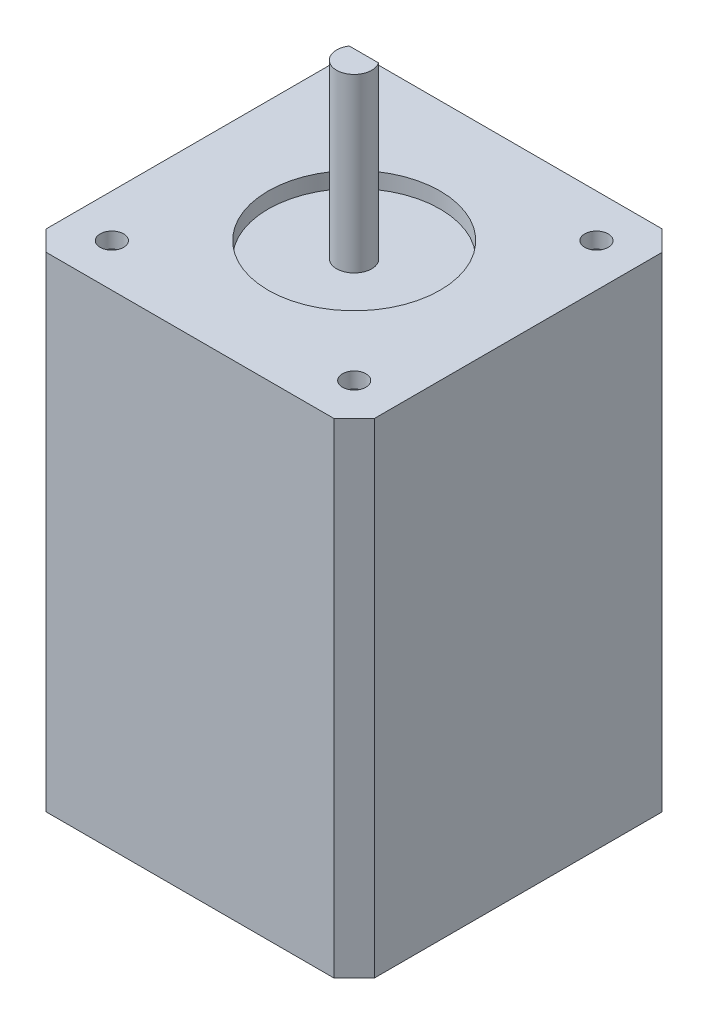
ISO-10303-21;
HEADER;
FILE_DESCRIPTION(('STEP AP214'),'2;1');
FILE_NAME('part.step','',(''),(''),'','','');
FILE_SCHEMA(('AUTOMOTIVE_DESIGN { 1 0 10303 214 1 1 1 1 }'));
ENDSEC;
DATA;
#1=APPLICATION_CONTEXT('core data for automotive mechanical design processes');
#2=APPLICATION_PROTOCOL_DEFINITION('international standard','automotive_design',2000,#1);
#3=PRODUCT_CONTEXT('',#1,'mechanical');
#4=PRODUCT('Part','Part','',(#3));
#5=PRODUCT_RELATED_PRODUCT_CATEGORY('part','',(#4));
#6=PRODUCT_DEFINITION_FORMATION('','',#4);
#7=PRODUCT_DEFINITION_CONTEXT('part definition',#1,'design');
#8=PRODUCT_DEFINITION('design','',#6,#7);
#9=PRODUCT_DEFINITION_SHAPE('','',#8);
#10=(LENGTH_UNIT() NAMED_UNIT(*) SI_UNIT(.MILLI.,.METRE.));
#11=(NAMED_UNIT(*) PLANE_ANGLE_UNIT() SI_UNIT($,.RADIAN.));
#12=(NAMED_UNIT(*) SI_UNIT($,.STERADIAN.) SOLID_ANGLE_UNIT());
#13=UNCERTAINTY_MEASURE_WITH_UNIT(LENGTH_MEASURE(1.E-05),#10,'distance_accuracy_value','');
#14=(GEOMETRIC_REPRESENTATION_CONTEXT(3) GLOBAL_UNCERTAINTY_ASSIGNED_CONTEXT((#13)) GLOBAL_UNIT_ASSIGNED_CONTEXT((#10,
#11,#12)) REPRESENTATION_CONTEXT('',''));
#15=CARTESIAN_POINT('',(0.,0.,0.));
#16=DIRECTION('',(0.,0.,1.));
#17=DIRECTION('',(1.,0.,0.));
#18=AXIS2_PLACEMENT_3D('',#15,#16,#17);
#19=CARTESIAN_POINT('',(15.5,-60.,-15.5));
#20=DIRECTION('',(0.,1.,0.));
#21=DIRECTION('',(0.,0.,1.));
#22=AXIS2_PLACEMENT_3D('',#19,#20,#21);
#23=CYLINDRICAL_SURFACE('',#22,1.5);
#24=CARTESIAN_POINT('',(15.5,2.,-15.5));
#25=DIRECTION('',(0.,1.,0.));
#26=DIRECTION('',(0.,0.,1.));
#27=AXIS2_PLACEMENT_3D('',#24,#25,#26);
#28=CIRCLE('',#27,1.5);
#29=CARTESIAN_POINT('',(15.5,2.,-14.));
#30=VERTEX_POINT('',#29);
#31=EDGE_CURVE('E149',#30,#30,#28,.T.);
#32=ORIENTED_EDGE('',*,*,#31,.T.);
#33=EDGE_LOOP('',(#32));
#34=FACE_BOUND('',#33,.T.);
#35=CARTESIAN_POINT('',(15.5,0.,-15.5));
#36=DIRECTION('',(0.,-1.,0.));
#37=DIRECTION('',(0.,0.,-1.));
#38=AXIS2_PLACEMENT_3D('',#35,#36,#37);
#39=CIRCLE('',#38,1.5);
#40=CARTESIAN_POINT('',(15.5,0.,-17.));
#41=VERTEX_POINT('',#40);
#42=EDGE_CURVE('E11',#41,#41,#39,.F.);
#43=ORIENTED_EDGE('',*,*,#42,.F.);
#44=EDGE_LOOP('',(#43));
#45=FACE_BOUND('',#44,.T.);
#46=ADVANCED_FACE('F41',(#34,#45),#23,.F.);
#47=CARTESIAN_POINT('',(-15.5,-60.,-15.5));
#48=DIRECTION('',(0.,1.,0.));
#49=DIRECTION('',(0.,0.,1.));
#50=AXIS2_PLACEMENT_3D('',#47,#48,#49);
#51=CYLINDRICAL_SURFACE('',#50,1.5);
#52=CARTESIAN_POINT('',(-15.5,2.,-15.5));
#53=DIRECTION('',(0.,1.,0.));
#54=DIRECTION('',(0.,0.,1.));
#55=AXIS2_PLACEMENT_3D('',#52,#53,#54);
#56=CIRCLE('',#55,1.5);
#57=CARTESIAN_POINT('',(-15.5,2.,-14.));
#58=VERTEX_POINT('',#57);
#59=EDGE_CURVE('E152',#58,#58,#56,.T.);
#60=ORIENTED_EDGE('',*,*,#59,.T.);
#61=EDGE_LOOP('',(#60));
#62=FACE_BOUND('',#61,.T.);
#63=CARTESIAN_POINT('',(-15.5,0.,-15.5));
#64=DIRECTION('',(0.,-1.,0.));
#65=DIRECTION('',(0.,0.,-1.));
#66=AXIS2_PLACEMENT_3D('',#63,#64,#65);
#67=CIRCLE('',#66,1.5);
#68=CARTESIAN_POINT('',(-15.5,0.,-17.));
#69=VERTEX_POINT('',#68);
#70=EDGE_CURVE('E49',#69,#69,#67,.F.);
#71=ORIENTED_EDGE('',*,*,#70,.F.);
#72=EDGE_LOOP('',(#71));
#73=FACE_BOUND('',#72,.T.);
#74=ADVANCED_FACE('F226',(#62,#73),#51,.F.);
#75=CARTESIAN_POINT('',(15.5,-60.,15.5));
#76=DIRECTION('',(0.,1.,0.));
#77=DIRECTION('',(0.,0.,1.));
#78=AXIS2_PLACEMENT_3D('',#75,#76,#77);
#79=CYLINDRICAL_SURFACE('',#78,1.5);
#80=CARTESIAN_POINT('',(15.5,2.,15.5));
#81=DIRECTION('',(0.,1.,0.));
#82=DIRECTION('',(0.,0.,1.));
#83=AXIS2_PLACEMENT_3D('',#80,#81,#82);
#84=CIRCLE('',#83,1.5);
#85=CARTESIAN_POINT('',(15.5,2.,17.));
#86=VERTEX_POINT('',#85);
#87=EDGE_CURVE('E143',#86,#86,#84,.T.);
#88=ORIENTED_EDGE('',*,*,#87,.T.);
#89=EDGE_LOOP('',(#88));
#90=FACE_BOUND('',#89,.T.);
#91=CARTESIAN_POINT('',(15.5,0.,15.5));
#92=DIRECTION('',(0.,-1.,0.));
#93=DIRECTION('',(0.,0.,-1.));
#94=AXIS2_PLACEMENT_3D('',#91,#92,#93);
#95=CIRCLE('',#94,1.5);
#96=CARTESIAN_POINT('',(15.5,0.,14.));
#97=VERTEX_POINT('',#96);
#98=EDGE_CURVE('E219',#97,#97,#95,.F.);
#99=ORIENTED_EDGE('',*,*,#98,.F.);
#100=EDGE_LOOP('',(#99));
#101=FACE_BOUND('',#100,.T.);
#102=ADVANCED_FACE('F228',(#90,#101),#79,.F.);
#103=CARTESIAN_POINT('',(-15.5,-60.,15.5));
#104=DIRECTION('',(0.,1.,0.));
#105=DIRECTION('',(0.,0.,1.));
#106=AXIS2_PLACEMENT_3D('',#103,#104,#105);
#107=CYLINDRICAL_SURFACE('',#106,1.5);
#108=CARTESIAN_POINT('',(-15.5,2.,15.5));
#109=DIRECTION('',(0.,1.,0.));
#110=DIRECTION('',(0.,0.,1.));
#111=AXIS2_PLACEMENT_3D('',#108,#109,#110);
#112=CIRCLE('',#111,1.5);
#113=CARTESIAN_POINT('',(-15.5,2.,17.));
#114=VERTEX_POINT('',#113);
#115=EDGE_CURVE('E146',#114,#114,#112,.T.);
#116=ORIENTED_EDGE('',*,*,#115,.T.);
#117=EDGE_LOOP('',(#116));
#118=FACE_BOUND('',#117,.T.);
#119=CARTESIAN_POINT('',(-15.5,0.,15.5));
#120=DIRECTION('',(0.,-1.,0.));
#121=DIRECTION('',(0.,0.,-1.));
#122=AXIS2_PLACEMENT_3D('',#119,#120,#121);
#123=CIRCLE('',#122,1.5);
#124=CARTESIAN_POINT('',(-15.5,0.,14.));
#125=VERTEX_POINT('',#124);
#126=EDGE_CURVE('E216',#125,#125,#123,.F.);
#127=ORIENTED_EDGE('',*,*,#126,.F.);
#128=EDGE_LOOP('',(#127));
#129=FACE_BOUND('',#128,.T.);
#130=ADVANCED_FACE('F235',(#118,#129),#107,.F.);
#131=CARTESIAN_POINT('',(0.,0.,0.));
#132=DIRECTION('',(0.,-1.,0.));
#133=DIRECTION('',(0.,0.,-1.));
#134=AXIS2_PLACEMENT_3D('',#131,#132,#133);
#135=PLANE('',#134);
#136=CARTESIAN_POINT('',(0.,0.,0.));
#137=DIRECTION('',(0.,-1.,0.));
#138=DIRECTION('',(0.,0.,-1.));
#139=AXIS2_PLACEMENT_3D('',#136,#137,#138);
#140=CIRCLE('',#139,11.);
#141=CARTESIAN_POINT('',(0.,0.,-11.));
#142=VERTEX_POINT('',#141);
#143=EDGE_CURVE('E200',#142,#142,#140,.F.);
#144=ORIENTED_EDGE('',*,*,#143,.T.);
#145=EDGE_LOOP('',(#144));
#146=FACE_BOUND('',#145,.T.);
#147=CARTESIAN_POINT('',(0.,0.,0.));
#148=DIRECTION('',(0.,1.,0.));
#149=DIRECTION('',(0.,0.,1.));
#150=AXIS2_PLACEMENT_3D('',#147,#148,#149);
#151=CIRCLE('',#150,2.25);
#152=CARTESIAN_POINT('',(-1.87082869338696,0.,-1.24999999999999));
#153=VERTEX_POINT('',#152);
#154=CARTESIAN_POINT('',(1.87082869338697,0.,-1.25));
#155=VERTEX_POINT('',#154);
#156=EDGE_CURVE('E55',#153,#155,#151,.T.);
#157=ORIENTED_EDGE('',*,*,#156,.F.);
#158=DIRECTION('',(1.,0.,0.));
#159=VECTOR('',#158,1.);
#160=CARTESIAN_POINT('',(0.,0.,-1.25));
#161=LINE('',#160,#159);
#162=EDGE_CURVE('E125',#153,#155,#161,.T.);
#163=ORIENTED_EDGE('',*,*,#162,.T.);
#164=EDGE_LOOP('',(#157,#163));
#165=FACE_BOUND('',#164,.T.);
#166=ADVANCED_FACE('F244',(#146,#165),#135,.F.);
#167=CARTESIAN_POINT('',(0.,-60.,0.));
#168=DIRECTION('',(0.,1.,0.));
#169=DIRECTION('',(0.,0.,1.));
#170=AXIS2_PLACEMENT_3D('',#167,#168,#169);
#171=CYLINDRICAL_SURFACE('',#170,11.);
#172=CARTESIAN_POINT('',(0.,2.,0.));
#173=DIRECTION('',(0.,1.,0.));
#174=DIRECTION('',(0.,0.,1.));
#175=AXIS2_PLACEMENT_3D('',#172,#173,#174);
#176=CIRCLE('',#175,11.);
#177=CARTESIAN_POINT('',(0.,2.,11.));
#178=VERTEX_POINT('',#177);
#179=EDGE_CURVE('E127',#178,#178,#176,.T.);
#180=ORIENTED_EDGE('',*,*,#179,.T.);
#181=EDGE_LOOP('',(#180));
#182=FACE_BOUND('',#181,.T.);
#183=ORIENTED_EDGE('',*,*,#143,.F.);
#184=EDGE_LOOP('',(#183));
#185=FACE_BOUND('',#184,.T.);
#186=ADVANCED_FACE('F43',(#182,#185),#171,.F.);
#187=CARTESIAN_POINT('',(19.7010309278352,-60.,19.701030927835));
#188=DIRECTION('',(-0.707106781186551,0.,-0.707106781186544));
#189=DIRECTION('',(-0.707106781186544,0.,0.707106781186551));
#190=AXIS2_PLACEMENT_3D('',#187,#188,#189);
#191=PLANE('',#190);
#192=DIRECTION('',(0.,1.,0.));
#193=VECTOR('',#192,1.);
#194=CARTESIAN_POINT('',(21.,-60.,18.4020618556701));
#195=LINE('',#194,#193);
#196=CARTESIAN_POINT('',(21.,-60.,18.4020618556701));
#197=VERTEX_POINT('',#196);
#198=CARTESIAN_POINT('',(21.,2.,18.4020618556701));
#199=VERTEX_POINT('',#198);
#200=EDGE_CURVE('E197',#197,#199,#195,.T.);
#201=ORIENTED_EDGE('',*,*,#200,.T.);
#202=DIRECTION('',(-0.707106781186544,0.,0.707106781186551));
#203=VECTOR('',#202,1.);
#204=CARTESIAN_POINT('',(19.7010309278352,2.,19.701030927835));
#205=LINE('',#204,#203);
#206=CARTESIAN_POINT('',(18.4020618556701,2.,21.));
#207=VERTEX_POINT('',#206);
#208=EDGE_CURVE('E155',#199,#207,#205,.T.);
#209=ORIENTED_EDGE('',*,*,#208,.T.);
#210=DIRECTION('',(0.,1.,0.));
#211=VECTOR('',#210,1.);
#212=CARTESIAN_POINT('',(18.4020618556701,-60.,21.));
#213=LINE('',#212,#211);
#214=CARTESIAN_POINT('',(18.4020618556701,-60.,21.));
#215=VERTEX_POINT('',#214);
#216=EDGE_CURVE('E198',#215,#207,#213,.T.);
#217=ORIENTED_EDGE('',*,*,#216,.F.);
#218=DIRECTION('',(-0.707106781186544,0.,0.707106781186551));
#219=VECTOR('',#218,1.);
#220=CARTESIAN_POINT('',(19.7010309278352,-60.,19.701030927835));
#221=LINE('',#220,#219);
#222=EDGE_CURVE('E63',#197,#215,#221,.T.);
#223=ORIENTED_EDGE('',*,*,#222,.F.);
#224=EDGE_LOOP('',(#201,#209,#217,#223));
#225=FACE_BOUND('',#224,.T.);
#226=ADVANCED_FACE('F240',(#225),#191,.F.);
#227=CARTESIAN_POINT('',(0.,-60.,21.));
#228=DIRECTION('',(0.,0.,1.));
#229=DIRECTION('',(1.,0.,0.));
#230=AXIS2_PLACEMENT_3D('',#227,#228,#229);
#231=PLANE('',#230);
#232=ORIENTED_EDGE('',*,*,#216,.T.);
#233=DIRECTION('',(1.,0.,0.));
#234=VECTOR('',#233,1.);
#235=CARTESIAN_POINT('',(0.,2.,21.));
#236=LINE('',#235,#234);
#237=CARTESIAN_POINT('',(-18.40206185567,2.,21.));
#238=VERTEX_POINT('',#237);
#239=EDGE_CURVE('E176',#238,#207,#236,.T.);
#240=ORIENTED_EDGE('',*,*,#239,.F.);
#241=DIRECTION('',(0.,1.,0.));
#242=VECTOR('',#241,1.);
#243=CARTESIAN_POINT('',(-18.40206185567,-60.,21.));
#244=LINE('',#243,#242);
#245=CARTESIAN_POINT('',(-18.40206185567,-60.,21.));
#246=VERTEX_POINT('',#245);
#247=EDGE_CURVE('E201',#246,#238,#244,.T.);
#248=ORIENTED_EDGE('',*,*,#247,.F.);
#249=DIRECTION('',(1.,0.,0.));
#250=VECTOR('',#249,1.);
#251=CARTESIAN_POINT('',(0.,-60.,21.));
#252=LINE('',#251,#250);
#253=EDGE_CURVE('E194',#246,#215,#252,.T.);
#254=ORIENTED_EDGE('',*,*,#253,.T.);
#255=EDGE_LOOP('',(#232,#240,#248,#254));
#256=FACE_BOUND('',#255,.T.);
#257=ADVANCED_FACE('F280',(#256),#231,.T.);
#258=CARTESIAN_POINT('',(-19.7010309278348,-60.,19.7010309278353));
#259=DIRECTION('',(-0.707106781186539,0.,0.707106781186556));
#260=DIRECTION('',(0.707106781186556,0.,0.707106781186539));
#261=AXIS2_PLACEMENT_3D('',#258,#259,#260);
#262=PLANE('',#261);
#263=ORIENTED_EDGE('',*,*,#247,.T.);
#264=DIRECTION('',(0.707106781186556,0.,0.707106781186539));
#265=VECTOR('',#264,1.);
#266=CARTESIAN_POINT('',(-19.7010309278348,2.,19.7010309278353));
#267=LINE('',#266,#265);
#268=CARTESIAN_POINT('',(-21.,2.,18.4020618556701));
#269=VERTEX_POINT('',#268);
#270=EDGE_CURVE('E173',#269,#238,#267,.T.);
#271=ORIENTED_EDGE('',*,*,#270,.F.);
#272=DIRECTION('',(0.,1.,0.));
#273=VECTOR('',#272,1.);
#274=CARTESIAN_POINT('',(-21.,-60.,18.4020618556701));
#275=LINE('',#274,#273);
#276=CARTESIAN_POINT('',(-21.,-60.,18.4020618556701));
#277=VERTEX_POINT('',#276);
#278=EDGE_CURVE('E203',#277,#269,#275,.T.);
#279=ORIENTED_EDGE('',*,*,#278,.F.);
#280=DIRECTION('',(0.707106781186556,0.,0.707106781186539));
#281=VECTOR('',#280,1.);
#282=CARTESIAN_POINT('',(-19.7010309278348,-60.,19.7010309278353));
#283=LINE('',#282,#281);
#284=EDGE_CURVE('E191',#277,#246,#283,.T.);
#285=ORIENTED_EDGE('',*,*,#284,.T.);
#286=EDGE_LOOP('',(#263,#271,#279,#285));
#287=FACE_BOUND('',#286,.T.);
#288=ADVANCED_FACE('F283',(#287),#262,.T.);
#289=CARTESIAN_POINT('',(-21.,-60.,0.));
#290=DIRECTION('',(-1.,0.,0.));
#291=DIRECTION('',(0.,0.,1.));
#292=AXIS2_PLACEMENT_3D('',#289,#290,#291);
#293=PLANE('',#292);
#294=ORIENTED_EDGE('',*,*,#278,.T.);
#295=DIRECTION('',(0.,0.,1.));
#296=VECTOR('',#295,1.);
#297=CARTESIAN_POINT('',(-21.,2.,0.));
#298=LINE('',#297,#296);
#299=CARTESIAN_POINT('',(-21.,2.,-18.3154639175258));
#300=VERTEX_POINT('',#299);
#301=EDGE_CURVE('E170',#300,#269,#298,.T.);
#302=ORIENTED_EDGE('',*,*,#301,.F.);
#303=DIRECTION('',(0.,1.,0.));
#304=VECTOR('',#303,1.);
#305=CARTESIAN_POINT('',(-21.,-60.,-18.3154639175258));
#306=LINE('',#305,#304);
#307=CARTESIAN_POINT('',(-21.,-60.,-18.3154639175258));
#308=VERTEX_POINT('',#307);
#309=EDGE_CURVE('E205',#308,#300,#306,.T.);
#310=ORIENTED_EDGE('',*,*,#309,.F.);
#311=DIRECTION('',(0.,0.,1.));
#312=VECTOR('',#311,1.);
#313=CARTESIAN_POINT('',(-21.,-60.,0.));
#314=LINE('',#313,#312);
#315=EDGE_CURVE('E188',#308,#277,#314,.T.);
#316=ORIENTED_EDGE('',*,*,#315,.T.);
#317=EDGE_LOOP('',(#294,#302,#310,#316));
#318=FACE_BOUND('',#317,.T.);
#319=ADVANCED_FACE('F287',(#318),#293,.T.);
#320=CARTESIAN_POINT('',(-19.6577319587629,-60.,-19.6577319587628));
#321=DIRECTION('',(0.707106781186549,0.,0.707106781186546));
#322=DIRECTION('',(0.707106781186546,0.,-0.707106781186549));
#323=AXIS2_PLACEMENT_3D('',#320,#321,#322);
#324=PLANE('',#323);
#325=ORIENTED_EDGE('',*,*,#309,.T.);
#326=DIRECTION('',(0.707106781186546,0.,-0.707106781186549));
#327=VECTOR('',#326,1.);
#328=CARTESIAN_POINT('',(-19.6577319587629,2.,-19.6577319587628));
#329=LINE('',#328,#327);
#330=CARTESIAN_POINT('',(-18.3154639175258,2.,-21.));
#331=VERTEX_POINT('',#330);
#332=EDGE_CURVE('E167',#300,#331,#329,.T.);
#333=ORIENTED_EDGE('',*,*,#332,.T.);
#334=DIRECTION('',(0.,1.,0.));
#335=VECTOR('',#334,1.);
#336=CARTESIAN_POINT('',(-18.3154639175258,-60.,-21.));
#337=LINE('',#336,#335);
#338=CARTESIAN_POINT('',(-18.3154639175258,-60.,-21.));
#339=VERTEX_POINT('',#338);
#340=EDGE_CURVE('E207',#339,#331,#337,.T.);
#341=ORIENTED_EDGE('',*,*,#340,.F.);
#342=DIRECTION('',(0.707106781186546,0.,-0.707106781186549));
#343=VECTOR('',#342,1.);
#344=CARTESIAN_POINT('',(-19.6577319587629,-60.,-19.6577319587628));
#345=LINE('',#344,#343);
#346=EDGE_CURVE('E186',#308,#339,#345,.T.);
#347=ORIENTED_EDGE('',*,*,#346,.F.);
#348=EDGE_LOOP('',(#325,#333,#341,#347));
#349=FACE_BOUND('',#348,.T.);
#350=ADVANCED_FACE('F291',(#349),#324,.F.);
#351=CARTESIAN_POINT('',(0.,-60.,-21.));
#352=DIRECTION('',(0.,0.,1.));
#353=DIRECTION('',(1.,0.,0.));
#354=AXIS2_PLACEMENT_3D('',#351,#352,#353);
#355=PLANE('',#354);
#356=ORIENTED_EDGE('',*,*,#340,.T.);
#357=DIRECTION('',(1.,0.,0.));
#358=VECTOR('',#357,1.);
#359=CARTESIAN_POINT('',(0.,2.,-21.));
#360=LINE('',#359,#358);
#361=CARTESIAN_POINT('',(18.3587628865979,2.,-21.));
#362=VERTEX_POINT('',#361);
#363=EDGE_CURVE('E164',#331,#362,#360,.T.);
#364=ORIENTED_EDGE('',*,*,#363,.T.);
#365=DIRECTION('',(0.,1.,0.));
#366=VECTOR('',#365,1.);
#367=CARTESIAN_POINT('',(18.3587628865979,-60.,-21.));
#368=LINE('',#367,#366);
#369=CARTESIAN_POINT('',(18.3587628865979,-60.,-21.));
#370=VERTEX_POINT('',#369);
#371=EDGE_CURVE('E209',#370,#362,#368,.T.);
#372=ORIENTED_EDGE('',*,*,#371,.F.);
#373=DIRECTION('',(1.,0.,0.));
#374=VECTOR('',#373,1.);
#375=CARTESIAN_POINT('',(0.,-60.,-21.));
#376=LINE('',#375,#374);
#377=EDGE_CURVE('E184',#339,#370,#376,.T.);
#378=ORIENTED_EDGE('',*,*,#377,.F.);
#379=EDGE_LOOP('',(#356,#364,#372,#378));
#380=FACE_BOUND('',#379,.T.);
#381=ADVANCED_FACE('F295',(#380),#355,.F.);
#382=CARTESIAN_POINT('',(19.679381443299,-60.,-19.679381443299));
#383=DIRECTION('',(-0.707106781186547,0.,0.707106781186547));
#384=DIRECTION('',(0.707106781186548,0.,0.707106781186548));
#385=AXIS2_PLACEMENT_3D('',#382,#383,#384);
#386=PLANE('',#385);
#387=ORIENTED_EDGE('',*,*,#371,.T.);
#388=DIRECTION('',(0.707106781186548,0.,0.707106781186548));
#389=VECTOR('',#388,1.);
#390=CARTESIAN_POINT('',(19.679381443299,2.,-19.679381443299));
#391=LINE('',#390,#389);
#392=CARTESIAN_POINT('',(21.,2.,-18.3587628865979));
#393=VERTEX_POINT('',#392);
#394=EDGE_CURVE('E161',#362,#393,#391,.T.);
#395=ORIENTED_EDGE('',*,*,#394,.T.);
#396=DIRECTION('',(0.,1.,0.));
#397=VECTOR('',#396,1.);
#398=CARTESIAN_POINT('',(21.,-60.,-18.3587628865979));
#399=LINE('',#398,#397);
#400=CARTESIAN_POINT('',(21.,-60.,-18.3587628865979));
#401=VERTEX_POINT('',#400);
#402=EDGE_CURVE('E211',#401,#393,#399,.T.);
#403=ORIENTED_EDGE('',*,*,#402,.F.);
#404=DIRECTION('',(0.707106781186548,0.,0.707106781186548));
#405=VECTOR('',#404,1.);
#406=CARTESIAN_POINT('',(19.679381443299,-60.,-19.679381443299));
#407=LINE('',#406,#405);
#408=EDGE_CURVE('E182',#370,#401,#407,.T.);
#409=ORIENTED_EDGE('',*,*,#408,.F.);
#410=EDGE_LOOP('',(#387,#395,#403,#409));
#411=FACE_BOUND('',#410,.T.);
#412=ADVANCED_FACE('F299',(#411),#386,.F.);
#413=CARTESIAN_POINT('',(21.,-60.,0.));
#414=DIRECTION('',(-1.,0.,0.));
#415=DIRECTION('',(0.,0.,1.));
#416=AXIS2_PLACEMENT_3D('',#413,#414,#415);
#417=PLANE('',#416);
#418=ORIENTED_EDGE('',*,*,#402,.T.);
#419=DIRECTION('',(0.,0.,1.));
#420=VECTOR('',#419,1.);
#421=CARTESIAN_POINT('',(21.,2.,0.));
#422=LINE('',#421,#420);
#423=EDGE_CURVE('E158',#393,#199,#422,.T.);
#424=ORIENTED_EDGE('',*,*,#423,.T.);
#425=ORIENTED_EDGE('',*,*,#200,.F.);
#426=DIRECTION('',(0.,0.,1.));
#427=VECTOR('',#426,1.);
#428=CARTESIAN_POINT('',(21.,-60.,0.));
#429=LINE('',#428,#427);
#430=EDGE_CURVE('E180',#401,#197,#429,.T.);
#431=ORIENTED_EDGE('',*,*,#430,.F.);
#432=EDGE_LOOP('',(#418,#424,#425,#431));
#433=FACE_BOUND('',#432,.T.);
#434=ADVANCED_FACE('F279',(#433),#417,.F.);
#435=CARTESIAN_POINT('',(0.,-60.,0.));
#436=DIRECTION('',(0.,1.,0.));
#437=DIRECTION('',(0.,0.,1.));
#438=AXIS2_PLACEMENT_3D('',#435,#436,#437);
#439=PLANE('',#438);
#440=ORIENTED_EDGE('',*,*,#222,.T.);
#441=ORIENTED_EDGE('',*,*,#253,.F.);
#442=ORIENTED_EDGE('',*,*,#284,.F.);
#443=ORIENTED_EDGE('',*,*,#315,.F.);
#444=ORIENTED_EDGE('',*,*,#346,.T.);
#445=ORIENTED_EDGE('',*,*,#377,.T.);
#446=ORIENTED_EDGE('',*,*,#408,.T.);
#447=ORIENTED_EDGE('',*,*,#430,.T.);
#448=EDGE_LOOP('',(#440,#441,#442,#443,#444,#445,#446,#447));
#449=FACE_BOUND('',#448,.T.);
#450=ADVANCED_FACE('F275',(#449),#439,.F.);
#451=CARTESIAN_POINT('',(0.,2.,0.));
#452=DIRECTION('',(0.,1.,0.));
#453=DIRECTION('',(0.,0.,1.));
#454=AXIS2_PLACEMENT_3D('',#451,#452,#453);
#455=PLANE('',#454);
#456=ORIENTED_EDGE('',*,*,#179,.F.);
#457=EDGE_LOOP('',(#456));
#458=FACE_BOUND('',#457,.T.);
#459=ORIENTED_EDGE('',*,*,#87,.F.);
#460=EDGE_LOOP('',(#459));
#461=FACE_BOUND('',#460,.T.);
#462=ORIENTED_EDGE('',*,*,#115,.F.);
#463=EDGE_LOOP('',(#462));
#464=FACE_BOUND('',#463,.T.);
#465=ORIENTED_EDGE('',*,*,#31,.F.);
#466=EDGE_LOOP('',(#465));
#467=FACE_BOUND('',#466,.T.);
#468=ORIENTED_EDGE('',*,*,#59,.F.);
#469=EDGE_LOOP('',(#468));
#470=FACE_BOUND('',#469,.T.);
#471=ORIENTED_EDGE('',*,*,#208,.F.);
#472=ORIENTED_EDGE('',*,*,#423,.F.);
#473=ORIENTED_EDGE('',*,*,#394,.F.);
#474=ORIENTED_EDGE('',*,*,#363,.F.);
#475=ORIENTED_EDGE('',*,*,#332,.F.);
#476=ORIENTED_EDGE('',*,*,#301,.T.);
#477=ORIENTED_EDGE('',*,*,#270,.T.);
#478=ORIENTED_EDGE('',*,*,#239,.T.);
#479=EDGE_LOOP('',(#471,#472,#473,#474,#475,#476,#477,#478));
#480=FACE_BOUND('',#479,.T.);
#481=ADVANCED_FACE('F271',(#458,#461,#464,#467,#470,#480),#455,.T.);
#482=CARTESIAN_POINT('',(0.,22.,-1.25));
#483=DIRECTION('',(0.,0.,-1.));
#484=DIRECTION('',(-1.,0.,0.));
#485=AXIS2_PLACEMENT_3D('',#482,#483,#484);
#486=PLANE('',#485);
#487=ORIENTED_EDGE('',*,*,#162,.F.);
#488=DIRECTION('',(0.,-1.,0.));
#489=VECTOR('',#488,1.);
#490=CARTESIAN_POINT('',(-1.87082869338697,22.,-1.25));
#491=LINE('',#490,#489);
#492=CARTESIAN_POINT('',(-1.87082869338697,22.,-1.25));
#493=VERTEX_POINT('',#492);
#494=EDGE_CURVE('E119',#493,#153,#491,.T.);
#495=ORIENTED_EDGE('',*,*,#494,.F.);
#496=DIRECTION('',(1.,0.,0.));
#497=VECTOR('',#496,1.);
#498=CARTESIAN_POINT('',(0.,22.,-1.25));
#499=LINE('',#498,#497);
#500=CARTESIAN_POINT('',(1.87082869338697,22.,-1.25));
#501=VERTEX_POINT('',#500);
#502=EDGE_CURVE('E124',#493,#501,#499,.T.);
#503=ORIENTED_EDGE('',*,*,#502,.T.);
#504=DIRECTION('',(0.,-1.,0.));
#505=VECTOR('',#504,1.);
#506=CARTESIAN_POINT('',(1.87082869338697,22.,-1.25));
#507=LINE('',#506,#505);
#508=EDGE_CURVE('E128',#501,#155,#507,.T.);
#509=ORIENTED_EDGE('',*,*,#508,.T.);
#510=EDGE_LOOP('',(#487,#495,#503,#509));
#511=FACE_BOUND('',#510,.T.);
#512=ADVANCED_FACE('F121',(#511),#486,.T.);
#513=CARTESIAN_POINT('',(0.,22.,0.));
#514=DIRECTION('',(0.,-1.,0.));
#515=DIRECTION('',(0.,0.,-1.));
#516=AXIS2_PLACEMENT_3D('',#513,#514,#515);
#517=CYLINDRICAL_SURFACE('',#516,2.25);
#518=ORIENTED_EDGE('',*,*,#156,.T.);
#519=ORIENTED_EDGE('',*,*,#508,.F.);
#520=CARTESIAN_POINT('',(0.,22.,0.));
#521=DIRECTION('',(0.,1.,0.));
#522=DIRECTION('',(0.,0.,1.));
#523=AXIS2_PLACEMENT_3D('',#520,#521,#522);
#524=CIRCLE('',#523,2.25);
#525=EDGE_CURVE('E131',#493,#501,#524,.T.);
#526=ORIENTED_EDGE('',*,*,#525,.F.);
#527=ORIENTED_EDGE('',*,*,#494,.T.);
#528=EDGE_LOOP('',(#518,#519,#526,#527));
#529=FACE_BOUND('',#528,.T.);
#530=ADVANCED_FACE('F132',(#529),#517,.T.);
#531=CARTESIAN_POINT('',(0.,22.,0.));
#532=DIRECTION('',(0.,1.,0.));
#533=DIRECTION('',(0.,0.,1.));
#534=AXIS2_PLACEMENT_3D('',#531,#532,#533);
#535=PLANE('',#534);
#536=ORIENTED_EDGE('',*,*,#502,.F.);
#537=ORIENTED_EDGE('',*,*,#525,.T.);
#538=EDGE_LOOP('',(#536,#537));
#539=FACE_BOUND('',#538,.T.);
#540=ADVANCED_FACE('F135',(#539),#535,.T.);
#541=CARTESIAN_POINT('',(-15.5,0.,15.5));
#542=DIRECTION('',(0.,-1.,0.));
#543=DIRECTION('',(0.,0.,-1.));
#544=AXIS2_PLACEMENT_3D('',#541,#542,#543);
#545=PLANE('',#544);
#546=ORIENTED_EDGE('',*,*,#126,.T.);
#547=EDGE_LOOP('',(#546));
#548=FACE_BOUND('',#547,.T.);
#549=ADVANCED_FACE('F255',(#548),#545,.F.);
#550=CARTESIAN_POINT('',(15.5,0.,15.5));
#551=DIRECTION('',(0.,-1.,0.));
#552=DIRECTION('',(0.,0.,-1.));
#553=AXIS2_PLACEMENT_3D('',#550,#551,#552);
#554=PLANE('',#553);
#555=ORIENTED_EDGE('',*,*,#98,.T.);
#556=EDGE_LOOP('',(#555));
#557=FACE_BOUND('',#556,.T.);
#558=ADVANCED_FACE('F257',(#557),#554,.F.);
#559=CARTESIAN_POINT('',(-15.5,0.,-15.5));
#560=DIRECTION('',(0.,-1.,0.));
#561=DIRECTION('',(0.,0.,-1.));
#562=AXIS2_PLACEMENT_3D('',#559,#560,#561);
#563=PLANE('',#562);
#564=ORIENTED_EDGE('',*,*,#70,.T.);
#565=EDGE_LOOP('',(#564));
#566=FACE_BOUND('',#565,.T.);
#567=ADVANCED_FACE('F224',(#566),#563,.F.);
#568=CARTESIAN_POINT('',(15.5,0.,-15.5));
#569=DIRECTION('',(0.,-1.,0.));
#570=DIRECTION('',(0.,0.,-1.));
#571=AXIS2_PLACEMENT_3D('',#568,#569,#570);
#572=PLANE('',#571);
#573=ORIENTED_EDGE('',*,*,#42,.T.);
#574=EDGE_LOOP('',(#573));
#575=FACE_BOUND('',#574,.T.);
#576=ADVANCED_FACE('F347',(#575),#572,.F.);
#577=CLOSED_SHELL('',(#46,#74,#102,#130,#166,#186,#226,#257,#288,#319,#350,#381,#412,#434,#450,
#481,#512,#530,#540,#549,#558,#567,#576));
#578=MANIFOLD_SOLID_BREP('B2',#577);
#579=ADVANCED_BREP_SHAPE_REPRESENTATION('',(#18,#578),#14);
#580=SHAPE_DEFINITION_REPRESENTATION(#9,#579);
ENDSEC;
END-ISO-10303-21;
